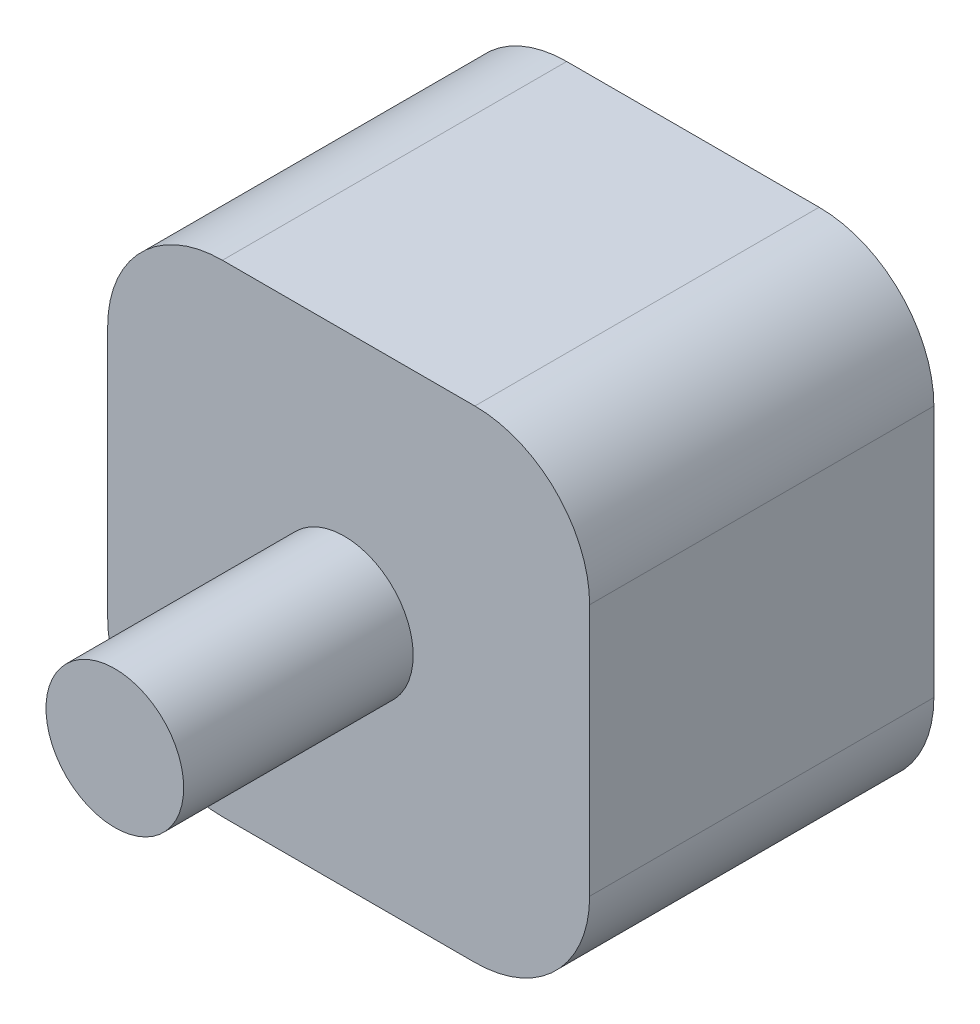
ISO-10303-21;
HEADER;
FILE_DESCRIPTION(('STEP AP214'),'2;1');
FILE_NAME('part.step','',(''),(''),'','','');
FILE_SCHEMA(('AUTOMOTIVE_DESIGN { 1 0 10303 214 1 1 1 1 }'));
ENDSEC;
DATA;
#1=APPLICATION_CONTEXT('core data for automotive mechanical design processes');
#2=APPLICATION_PROTOCOL_DEFINITION('international standard','automotive_design',2000,#1);
#3=PRODUCT_CONTEXT('',#1,'mechanical');
#4=PRODUCT('Part','Part','',(#3));
#5=PRODUCT_RELATED_PRODUCT_CATEGORY('part','',(#4));
#6=PRODUCT_DEFINITION_FORMATION('','',#4);
#7=PRODUCT_DEFINITION_CONTEXT('part definition',#1,'design');
#8=PRODUCT_DEFINITION('design','',#6,#7);
#9=PRODUCT_DEFINITION_SHAPE('','',#8);
#10=(LENGTH_UNIT() NAMED_UNIT(*) SI_UNIT(.MILLI.,.METRE.));
#11=(NAMED_UNIT(*) PLANE_ANGLE_UNIT() SI_UNIT($,.RADIAN.));
#12=(NAMED_UNIT(*) SI_UNIT($,.STERADIAN.) SOLID_ANGLE_UNIT());
#13=UNCERTAINTY_MEASURE_WITH_UNIT(LENGTH_MEASURE(1.E-05),#10,'distance_accuracy_value','');
#14=(GEOMETRIC_REPRESENTATION_CONTEXT(3) GLOBAL_UNCERTAINTY_ASSIGNED_CONTEXT((#13)) GLOBAL_UNIT_ASSIGNED_CONTEXT((#10,
#11,#12)) REPRESENTATION_CONTEXT('',''));
#15=CARTESIAN_POINT('',(0.,0.,0.));
#16=DIRECTION('',(0.,0.,1.));
#17=DIRECTION('',(1.,0.,0.));
#18=AXIS2_PLACEMENT_3D('',#15,#16,#17);
#19=CARTESIAN_POINT('',(0.,0.,50.));
#20=DIRECTION('',(0.,0.,-1.));
#21=DIRECTION('',(-1.,0.,0.));
#22=AXIS2_PLACEMENT_3D('',#19,#20,#21);
#23=CYLINDRICAL_SURFACE('',#22,6.);
#24=CARTESIAN_POINT('',(0.,0.,50.));
#25=DIRECTION('',(0.,0.,1.));
#26=DIRECTION('',(1.,0.,0.));
#27=AXIS2_PLACEMENT_3D('',#24,#25,#26);
#28=CIRCLE('',#27,6.);
#29=CARTESIAN_POINT('',(6.,0.,50.));
#30=VERTEX_POINT('',#29);
#31=EDGE_CURVE('E11',#30,#30,#28,.T.);
#32=ORIENTED_EDGE('',*,*,#31,.F.);
#33=EDGE_LOOP('',(#32));
#34=FACE_BOUND('',#33,.T.);
#35=CARTESIAN_POINT('',(0.,0.,30.));
#36=DIRECTION('',(0.,0.,1.));
#37=DIRECTION('',(1.,0.,0.));
#38=AXIS2_PLACEMENT_3D('',#35,#36,#37);
#39=CIRCLE('',#38,6.);
#40=CARTESIAN_POINT('',(6.,0.,30.));
#41=VERTEX_POINT('',#40);
#42=EDGE_CURVE('E44',#41,#41,#39,.T.);
#43=ORIENTED_EDGE('',*,*,#42,.T.);
#44=EDGE_LOOP('',(#43));
#45=FACE_BOUND('',#44,.T.);
#46=ADVANCED_FACE('F41',(#34,#45),#23,.T.);
#47=CARTESIAN_POINT('',(0.,0.,50.));
#48=DIRECTION('',(0.,0.,1.));
#49=DIRECTION('',(1.,0.,0.));
#50=AXIS2_PLACEMENT_3D('',#47,#48,#49);
#51=PLANE('',#50);
#52=ORIENTED_EDGE('',*,*,#31,.T.);
#53=EDGE_LOOP('',(#52));
#54=FACE_BOUND('',#53,.T.);
#55=ADVANCED_FACE('F56',(#54),#51,.T.);
#56=CARTESIAN_POINT('',(0.,0.,30.));
#57=DIRECTION('',(0.,0.,1.));
#58=DIRECTION('',(1.,0.,0.));
#59=AXIS2_PLACEMENT_3D('',#56,#57,#58);
#60=PLANE('',#59);
#61=ORIENTED_EDGE('',*,*,#42,.F.);
#62=EDGE_LOOP('',(#61));
#63=FACE_BOUND('',#62,.T.);
#64=ADVANCED_FACE('F54',(#63),#60,.F.);
#65=CLOSED_SHELL('',(#46,#55,#64));
#66=MANIFOLD_SOLID_BREP('B2',#65);
#67=CARTESIAN_POINT('',(11.3765698405817,-10.4895117817598,30.));
#68=DIRECTION('',(0.,0.,-1.));
#69=DIRECTION('',(-1.,0.,0.));
#70=AXIS2_PLACEMENT_3D('',#67,#68,#69);
#71=CYLINDRICAL_SURFACE('',#70,10.);
#72=DIRECTION('',(0.,0.,1.));
#73=VECTOR('',#72,1.);
#74=CARTESIAN_POINT('',(11.3765698405817,-20.4895117817598,30.));
#75=LINE('',#74,#73);
#76=CARTESIAN_POINT('',(11.3765698405817,-20.4895117817598,0.));
#77=VERTEX_POINT('',#76);
#78=CARTESIAN_POINT('',(11.3765698405817,-20.4895117817598,30.));
#79=VERTEX_POINT('',#78);
#80=EDGE_CURVE('E199',#77,#79,#75,.T.);
#81=ORIENTED_EDGE('',*,*,#80,.F.);
#82=CARTESIAN_POINT('',(11.3765698405817,-10.4895117817598,0.));
#83=DIRECTION('',(0.,0.,-1.));
#84=DIRECTION('',(-1.,0.,0.));
#85=AXIS2_PLACEMENT_3D('',#82,#83,#84);
#86=CIRCLE('',#85,10.);
#87=CARTESIAN_POINT('',(21.3765698405817,-10.4895117817597,0.));
#88=VERTEX_POINT('',#87);
#89=EDGE_CURVE('E89',#88,#77,#86,.T.);
#90=ORIENTED_EDGE('',*,*,#89,.F.);
#91=DIRECTION('',(0.,0.,1.));
#92=VECTOR('',#91,1.);
#93=CARTESIAN_POINT('',(21.3765698405817,-10.4895117817598,30.));
#94=LINE('',#93,#92);
#95=CARTESIAN_POINT('',(21.3765698405817,-10.4895117817597,30.));
#96=VERTEX_POINT('',#95);
#97=EDGE_CURVE('E202',#96,#88,#94,.F.);
#98=ORIENTED_EDGE('',*,*,#97,.F.);
#99=CARTESIAN_POINT('',(11.3765698405817,-10.4895117817598,30.));
#100=DIRECTION('',(0.,0.,-1.));
#101=DIRECTION('',(-1.,0.,0.));
#102=AXIS2_PLACEMENT_3D('',#99,#100,#101);
#103=CIRCLE('',#102,10.);
#104=EDGE_CURVE('E39',#79,#96,#103,.F.);
#105=ORIENTED_EDGE('',*,*,#104,.F.);
#106=EDGE_LOOP('',(#81,#90,#98,#105));
#107=FACE_BOUND('',#106,.T.);
#108=ADVANCED_FACE('F82',(#107),#71,.T.);
#109=CARTESIAN_POINT('',(-10.6234301594183,-10.4895117817598,30.));
#110=DIRECTION('',(0.,0.,1.));
#111=DIRECTION('',(1.,0.,0.));
#112=AXIS2_PLACEMENT_3D('',#109,#110,#111);
#113=CYLINDRICAL_SURFACE('',#112,10.);
#114=DIRECTION('',(0.,0.,1.));
#115=VECTOR('',#114,1.);
#116=CARTESIAN_POINT('',(-20.6234301594183,-10.4895117817598,30.));
#117=LINE('',#116,#115);
#118=CARTESIAN_POINT('',(-20.6234301594183,-10.4895117817598,0.));
#119=VERTEX_POINT('',#118);
#120=CARTESIAN_POINT('',(-20.6234301594183,-10.4895117817598,30.));
#121=VERTEX_POINT('',#120);
#122=EDGE_CURVE('E189',#119,#121,#117,.T.);
#123=ORIENTED_EDGE('',*,*,#122,.F.);
#124=CARTESIAN_POINT('',(-10.6234301594183,-10.4895117817598,0.));
#125=DIRECTION('',(0.,0.,-1.));
#126=DIRECTION('',(-1.,0.,0.));
#127=AXIS2_PLACEMENT_3D('',#124,#125,#126);
#128=CIRCLE('',#127,10.);
#129=CARTESIAN_POINT('',(-10.6234301594183,-20.4895117817598,0.));
#130=VERTEX_POINT('',#129);
#131=EDGE_CURVE('E195',#130,#119,#128,.T.);
#132=ORIENTED_EDGE('',*,*,#131,.F.);
#133=DIRECTION('',(0.,0.,1.));
#134=VECTOR('',#133,1.);
#135=CARTESIAN_POINT('',(-10.6234301594183,-20.4895117817598,30.));
#136=LINE('',#135,#134);
#137=CARTESIAN_POINT('',(-10.6234301594183,-20.4895117817598,30.));
#138=VERTEX_POINT('',#137);
#139=EDGE_CURVE('E192',#138,#130,#136,.F.);
#140=ORIENTED_EDGE('',*,*,#139,.F.);
#141=CARTESIAN_POINT('',(-10.6234301594183,-10.4895117817598,30.));
#142=DIRECTION('',(0.,0.,-1.));
#143=DIRECTION('',(-1.,0.,0.));
#144=AXIS2_PLACEMENT_3D('',#141,#142,#143);
#145=CIRCLE('',#144,10.);
#146=EDGE_CURVE('E197',#121,#138,#145,.F.);
#147=ORIENTED_EDGE('',*,*,#146,.F.);
#148=EDGE_LOOP('',(#123,#132,#140,#147));
#149=FACE_BOUND('',#148,.T.);
#150=ADVANCED_FACE('F228',(#149),#113,.T.);
#151=CARTESIAN_POINT('',(-10.6234301594183,11.5104882182402,30.));
#152=DIRECTION('',(0.,0.,-1.));
#153=DIRECTION('',(-1.,0.,0.));
#154=AXIS2_PLACEMENT_3D('',#151,#152,#153);
#155=CYLINDRICAL_SURFACE('',#154,10.);
#156=DIRECTION('',(0.,0.,1.));
#157=VECTOR('',#156,1.);
#158=CARTESIAN_POINT('',(-10.6234301594183,21.5104882182402,30.));
#159=LINE('',#158,#157);
#160=CARTESIAN_POINT('',(-10.6234301594183,21.5104882182402,0.));
#161=VERTEX_POINT('',#160);
#162=CARTESIAN_POINT('',(-10.6234301594183,21.5104882182402,30.));
#163=VERTEX_POINT('',#162);
#164=EDGE_CURVE('E164',#161,#163,#159,.T.);
#165=ORIENTED_EDGE('',*,*,#164,.F.);
#166=CARTESIAN_POINT('',(-10.6234301594183,11.5104882182402,0.));
#167=DIRECTION('',(0.,0.,-1.));
#168=DIRECTION('',(-1.,0.,0.));
#169=AXIS2_PLACEMENT_3D('',#166,#167,#168);
#170=CIRCLE('',#169,10.);
#171=CARTESIAN_POINT('',(-20.6234301594183,11.5104882182402,0.));
#172=VERTEX_POINT('',#171);
#173=EDGE_CURVE('E150',#172,#161,#170,.T.);
#174=ORIENTED_EDGE('',*,*,#173,.F.);
#175=DIRECTION('',(0.,0.,1.));
#176=VECTOR('',#175,1.);
#177=CARTESIAN_POINT('',(-20.6234301594183,11.5104882182402,30.));
#178=LINE('',#177,#176);
#179=CARTESIAN_POINT('',(-20.6234301594183,11.5104882182402,30.));
#180=VERTEX_POINT('',#179);
#181=EDGE_CURVE('E183',#180,#172,#178,.F.);
#182=ORIENTED_EDGE('',*,*,#181,.F.);
#183=CARTESIAN_POINT('',(-10.6234301594183,11.5104882182402,30.));
#184=DIRECTION('',(0.,0.,-1.));
#185=DIRECTION('',(-1.,0.,0.));
#186=AXIS2_PLACEMENT_3D('',#183,#184,#185);
#187=CIRCLE('',#186,10.);
#188=EDGE_CURVE('E187',#163,#180,#187,.F.);
#189=ORIENTED_EDGE('',*,*,#188,.F.);
#190=EDGE_LOOP('',(#165,#174,#182,#189));
#191=FACE_BOUND('',#190,.T.);
#192=ADVANCED_FACE('F223',(#191),#155,.T.);
#193=CARTESIAN_POINT('',(11.3765698405817,11.5104882182402,30.));
#194=DIRECTION('',(0.,0.,-1.));
#195=DIRECTION('',(-1.,0.,0.));
#196=AXIS2_PLACEMENT_3D('',#193,#194,#195);
#197=CYLINDRICAL_SURFACE('',#196,10.);
#198=DIRECTION('',(0.,0.,-1.));
#199=VECTOR('',#198,1.);
#200=CARTESIAN_POINT('',(11.3765698405817,21.5104882182402,30.));
#201=LINE('',#200,#199);
#202=CARTESIAN_POINT('',(11.3765698405817,21.5104882182402,30.));
#203=VERTEX_POINT('',#202);
#204=CARTESIAN_POINT('',(11.3765698405817,21.5104882182402,0.));
#205=VERTEX_POINT('',#204);
#206=EDGE_CURVE('E160',#203,#205,#201,.T.);
#207=ORIENTED_EDGE('',*,*,#206,.F.);
#208=CARTESIAN_POINT('',(11.3765698405817,11.5104882182402,30.));
#209=DIRECTION('',(0.,0.,-1.));
#210=DIRECTION('',(-1.,0.,0.));
#211=AXIS2_PLACEMENT_3D('',#208,#209,#210);
#212=CIRCLE('',#211,10.);
#213=CARTESIAN_POINT('',(21.3765698405817,11.5104882182402,30.));
#214=VERTEX_POINT('',#213);
#215=EDGE_CURVE('E165',#214,#203,#212,.F.);
#216=ORIENTED_EDGE('',*,*,#215,.F.);
#217=DIRECTION('',(0.,0.,-1.));
#218=VECTOR('',#217,1.);
#219=CARTESIAN_POINT('',(21.3765698405817,11.5104882182402,30.));
#220=LINE('',#219,#218);
#221=CARTESIAN_POINT('',(21.3765698405817,11.5104882182402,0.));
#222=VERTEX_POINT('',#221);
#223=EDGE_CURVE('E162',#222,#214,#220,.F.);
#224=ORIENTED_EDGE('',*,*,#223,.F.);
#225=CARTESIAN_POINT('',(11.3765698405817,11.5104882182402,0.));
#226=DIRECTION('',(0.,0.,-1.));
#227=DIRECTION('',(-1.,0.,0.));
#228=AXIS2_PLACEMENT_3D('',#225,#226,#227);
#229=CIRCLE('',#228,10.);
#230=EDGE_CURVE('E147',#205,#222,#229,.T.);
#231=ORIENTED_EDGE('',*,*,#230,.F.);
#232=EDGE_LOOP('',(#207,#216,#224,#231));
#233=FACE_BOUND('',#232,.T.);
#234=ADVANCED_FACE('F159',(#233),#197,.T.);
#235=CARTESIAN_POINT('',(-20.6234301594183,21.5104882182402,30.));
#236=DIRECTION('',(0.,1.,0.));
#237=DIRECTION('',(0.,0.,1.));
#238=AXIS2_PLACEMENT_3D('',#235,#236,#237);
#239=PLANE('',#238);
#240=DIRECTION('',(1.,0.,0.));
#241=VECTOR('',#240,1.);
#242=CARTESIAN_POINT('',(-20.6234301594183,21.5104882182402,0.));
#243=LINE('',#242,#241);
#244=EDGE_CURVE('E143',#161,#205,#243,.T.);
#245=ORIENTED_EDGE('',*,*,#244,.F.);
#246=ORIENTED_EDGE('',*,*,#164,.T.);
#247=DIRECTION('',(1.,0.,0.));
#248=VECTOR('',#247,1.);
#249=CARTESIAN_POINT('',(-20.6234301594183,21.5104882182402,30.));
#250=LINE('',#249,#248);
#251=EDGE_CURVE('E169',#163,#203,#250,.T.);
#252=ORIENTED_EDGE('',*,*,#251,.T.);
#253=ORIENTED_EDGE('',*,*,#206,.T.);
#254=EDGE_LOOP('',(#245,#246,#252,#253));
#255=FACE_BOUND('',#254,.T.);
#256=ADVANCED_FACE('F167',(#255),#239,.T.);
#257=CARTESIAN_POINT('',(-20.6234301594183,21.5104882182402,30.));
#258=DIRECTION('',(1.,0.,0.));
#259=DIRECTION('',(0.,1.,0.));
#260=AXIS2_PLACEMENT_3D('',#257,#258,#259);
#261=PLANE('',#260);
#262=DIRECTION('',(0.,-1.,0.));
#263=VECTOR('',#262,1.);
#264=CARTESIAN_POINT('',(-20.6234301594183,21.5104882182402,0.));
#265=LINE('',#264,#263);
#266=EDGE_CURVE('E178',#172,#119,#265,.T.);
#267=ORIENTED_EDGE('',*,*,#266,.T.);
#268=ORIENTED_EDGE('',*,*,#122,.T.);
#269=DIRECTION('',(0.,-1.,0.));
#270=VECTOR('',#269,1.);
#271=CARTESIAN_POINT('',(-20.6234301594183,21.5104882182402,30.));
#272=LINE('',#271,#270);
#273=EDGE_CURVE('E171',#180,#121,#272,.T.);
#274=ORIENTED_EDGE('',*,*,#273,.F.);
#275=ORIENTED_EDGE('',*,*,#181,.T.);
#276=EDGE_LOOP('',(#267,#268,#274,#275));
#277=FACE_BOUND('',#276,.T.);
#278=ADVANCED_FACE('F225',(#277),#261,.F.);
#279=CARTESIAN_POINT('',(-20.6234301594183,-20.4895117817598,30.));
#280=DIRECTION('',(0.,1.,0.));
#281=DIRECTION('',(0.,0.,1.));
#282=AXIS2_PLACEMENT_3D('',#279,#280,#281);
#283=PLANE('',#282);
#284=DIRECTION('',(1.,0.,0.));
#285=VECTOR('',#284,1.);
#286=CARTESIAN_POINT('',(-20.6234301594183,-20.4895117817598,0.));
#287=LINE('',#286,#285);
#288=EDGE_CURVE('E205',#130,#77,#287,.T.);
#289=ORIENTED_EDGE('',*,*,#288,.T.);
#290=ORIENTED_EDGE('',*,*,#80,.T.);
#291=DIRECTION('',(1.,0.,0.));
#292=VECTOR('',#291,1.);
#293=CARTESIAN_POINT('',(-20.6234301594183,-20.4895117817598,30.));
#294=LINE('',#293,#292);
#295=EDGE_CURVE('E175',#138,#79,#294,.T.);
#296=ORIENTED_EDGE('',*,*,#295,.F.);
#297=ORIENTED_EDGE('',*,*,#139,.T.);
#298=EDGE_LOOP('',(#289,#290,#296,#297));
#299=FACE_BOUND('',#298,.T.);
#300=ADVANCED_FACE('F208',(#299),#283,.F.);
#301=CARTESIAN_POINT('',(21.3765698405817,21.5104882182402,30.));
#302=DIRECTION('',(1.,0.,0.));
#303=DIRECTION('',(0.,1.,0.));
#304=AXIS2_PLACEMENT_3D('',#301,#302,#303);
#305=PLANE('',#304);
#306=DIRECTION('',(0.,-1.,0.));
#307=VECTOR('',#306,1.);
#308=CARTESIAN_POINT('',(21.3765698405817,21.5104882182402,30.));
#309=LINE('',#308,#307);
#310=EDGE_CURVE('E214',#214,#96,#309,.T.);
#311=ORIENTED_EDGE('',*,*,#310,.T.);
#312=ORIENTED_EDGE('',*,*,#97,.T.);
#313=DIRECTION('',(0.,-1.,0.));
#314=VECTOR('',#313,1.);
#315=CARTESIAN_POINT('',(21.3765698405817,21.5104882182402,0.));
#316=LINE('',#315,#314);
#317=EDGE_CURVE('E155',#222,#88,#316,.T.);
#318=ORIENTED_EDGE('',*,*,#317,.F.);
#319=ORIENTED_EDGE('',*,*,#223,.T.);
#320=EDGE_LOOP('',(#311,#312,#318,#319));
#321=FACE_BOUND('',#320,.T.);
#322=ADVANCED_FACE('F218',(#321),#305,.T.);
#323=CARTESIAN_POINT('',(0.,0.,30.));
#324=DIRECTION('',(0.,0.,-1.));
#325=DIRECTION('',(-1.,0.,0.));
#326=AXIS2_PLACEMENT_3D('',#323,#324,#325);
#327=PLANE('',#326);
#328=ORIENTED_EDGE('',*,*,#295,.T.);
#329=ORIENTED_EDGE('',*,*,#104,.T.);
#330=ORIENTED_EDGE('',*,*,#310,.F.);
#331=ORIENTED_EDGE('',*,*,#215,.T.);
#332=ORIENTED_EDGE('',*,*,#251,.F.);
#333=ORIENTED_EDGE('',*,*,#188,.T.);
#334=ORIENTED_EDGE('',*,*,#273,.T.);
#335=ORIENTED_EDGE('',*,*,#146,.T.);
#336=EDGE_LOOP('',(#328,#329,#330,#331,#332,#333,#334,#335));
#337=FACE_BOUND('',#336,.T.);
#338=ADVANCED_FACE('F219',(#337),#327,.F.);
#339=CARTESIAN_POINT('',(0.,0.,0.));
#340=DIRECTION('',(0.,0.,-1.));
#341=DIRECTION('',(-1.,0.,0.));
#342=AXIS2_PLACEMENT_3D('',#339,#340,#341);
#343=PLANE('',#342);
#344=ORIENTED_EDGE('',*,*,#317,.T.);
#345=ORIENTED_EDGE('',*,*,#89,.T.);
#346=ORIENTED_EDGE('',*,*,#288,.F.);
#347=ORIENTED_EDGE('',*,*,#131,.T.);
#348=ORIENTED_EDGE('',*,*,#266,.F.);
#349=ORIENTED_EDGE('',*,*,#173,.T.);
#350=ORIENTED_EDGE('',*,*,#244,.T.);
#351=ORIENTED_EDGE('',*,*,#230,.T.);
#352=EDGE_LOOP('',(#344,#345,#346,#347,#348,#349,#350,#351));
#353=FACE_BOUND('',#352,.T.);
#354=ADVANCED_FACE('F146',(#353),#343,.T.);
#355=CLOSED_SHELL('',(#108,#150,#192,#234,#256,#278,#300,#322,#338,#354));
#356=MANIFOLD_SOLID_BREP('B6',#355);
#357=ADVANCED_BREP_SHAPE_REPRESENTATION('',(#18,#66,#356),#14);
#358=SHAPE_DEFINITION_REPRESENTATION(#9,#357);
ENDSEC;
END-ISO-10303-21;
